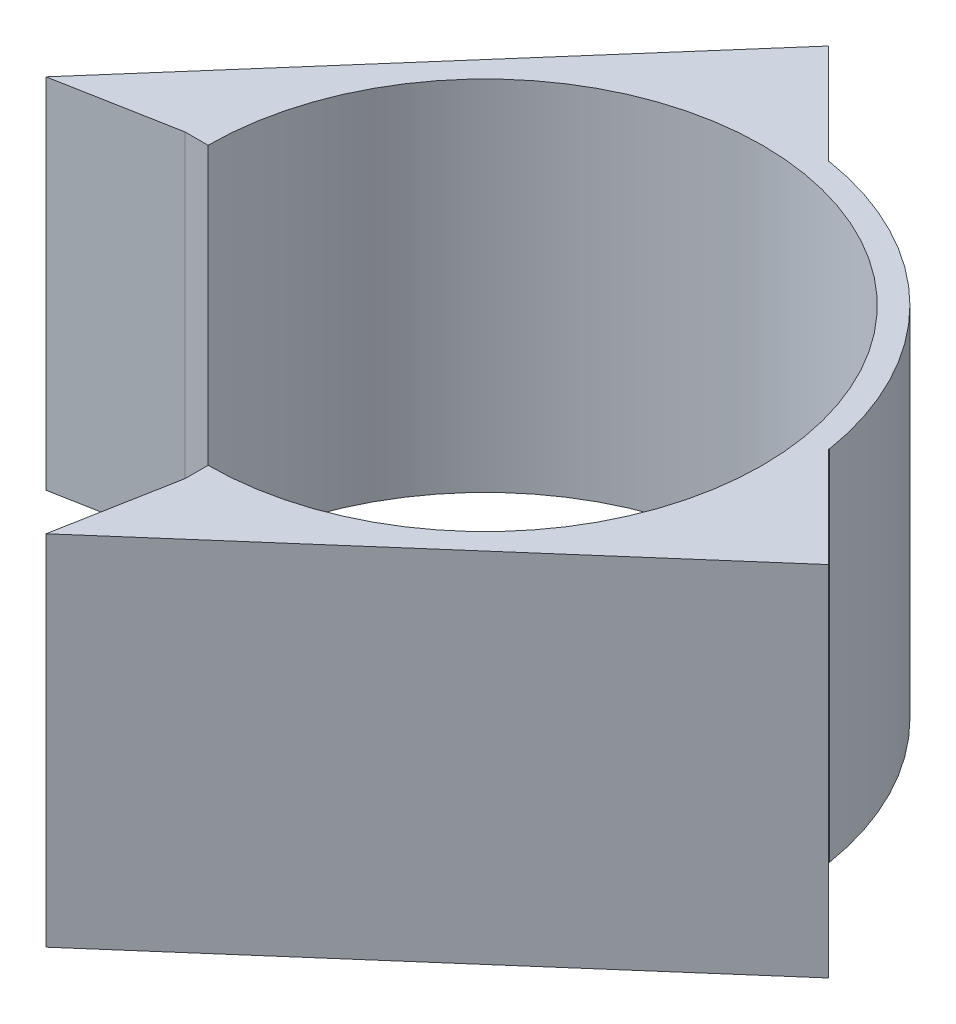
ISO-10303-21;
HEADER;
FILE_DESCRIPTION(('STEP AP214'),'2;1');
FILE_NAME('part.step','',(''),(''),'','','');
FILE_SCHEMA(('AUTOMOTIVE_DESIGN { 1 0 10303 214 1 1 1 1 }'));
ENDSEC;
DATA;
#1=APPLICATION_CONTEXT('core data for automotive mechanical design processes');
#2=APPLICATION_PROTOCOL_DEFINITION('international standard','automotive_design',2000,#1);
#3=PRODUCT_CONTEXT('',#1,'mechanical');
#4=PRODUCT('Part','Part','',(#3));
#5=PRODUCT_RELATED_PRODUCT_CATEGORY('part','',(#4));
#6=PRODUCT_DEFINITION_FORMATION('','',#4);
#7=PRODUCT_DEFINITION_CONTEXT('part definition',#1,'design');
#8=PRODUCT_DEFINITION('design','',#6,#7);
#9=PRODUCT_DEFINITION_SHAPE('','',#8);
#10=(LENGTH_UNIT() NAMED_UNIT(*) SI_UNIT(.MILLI.,.METRE.));
#11=(NAMED_UNIT(*) PLANE_ANGLE_UNIT() SI_UNIT($,.RADIAN.));
#12=(NAMED_UNIT(*) SI_UNIT($,.STERADIAN.) SOLID_ANGLE_UNIT());
#13=UNCERTAINTY_MEASURE_WITH_UNIT(LENGTH_MEASURE(1.E-05),#10,'distance_accuracy_value','');
#14=(GEOMETRIC_REPRESENTATION_CONTEXT(3) GLOBAL_UNCERTAINTY_ASSIGNED_CONTEXT((#13)) GLOBAL_UNIT_ASSIGNED_CONTEXT((#10,
#11,#12)) REPRESENTATION_CONTEXT('',''));
#15=CARTESIAN_POINT('',(0.,0.,0.));
#16=DIRECTION('',(0.,0.,1.));
#17=DIRECTION('',(1.,0.,0.));
#18=AXIS2_PLACEMENT_3D('',#15,#16,#17);
#19=CARTESIAN_POINT('',(0.,62.,0.));
#20=DIRECTION('',(0.,-1.,0.));
#21=DIRECTION('',(0.,0.,-1.));
#22=AXIS2_PLACEMENT_3D('',#19,#20,#21);
#23=CYLINDRICAL_SURFACE('',#22,52.000074421814);
#24=DIRECTION('',(0.,-1.,0.));
#25=VECTOR('',#24,1.);
#26=CARTESIAN_POINT('',(8.22813760226354,62.,-51.3449655903323));
#27=LINE('',#26,#25);
#28=CARTESIAN_POINT('',(8.22813760226354,62.,-51.3449655903323));
#29=VERTEX_POINT('',#28);
#30=CARTESIAN_POINT('',(8.22813760226354,0.,-51.3449655903323));
#31=VERTEX_POINT('',#30);
#32=EDGE_CURVE('E48',#29,#31,#27,.T.);
#33=ORIENTED_EDGE('',*,*,#32,.F.);
#34=CARTESIAN_POINT('',(0.,62.,0.));
#35=DIRECTION('',(0.,1.,0.));
#36=DIRECTION('',(0.,0.,-1.));
#37=AXIS2_PLACEMENT_3D('',#34,#35,#36);
#38=CIRCLE('',#37,52.000074421814);
#39=CARTESIAN_POINT('',(51.3449530492,62.,-8.22821586066177));
#40=VERTEX_POINT('',#39);
#41=EDGE_CURVE('E168',#40,#29,#38,.T.);
#42=ORIENTED_EDGE('',*,*,#41,.F.);
#43=DIRECTION('',(0.,-1.,0.));
#44=VECTOR('',#43,1.);
#45=CARTESIAN_POINT('',(51.3449530492,62.,-8.22821586066177));
#46=LINE('',#45,#44);
#47=CARTESIAN_POINT('',(51.3449530492,0.,-8.22821586066177));
#48=VERTEX_POINT('',#47);
#49=EDGE_CURVE('E150',#40,#48,#46,.T.);
#50=ORIENTED_EDGE('',*,*,#49,.T.);
#51=CARTESIAN_POINT('',(0.,0.,0.));
#52=DIRECTION('',(0.,1.,0.));
#53=DIRECTION('',(0.,0.,-1.));
#54=AXIS2_PLACEMENT_3D('',#51,#52,#53);
#55=CIRCLE('',#54,52.000074421814);
#56=EDGE_CURVE('E187',#48,#31,#55,.T.);
#57=ORIENTED_EDGE('',*,*,#56,.T.);
#58=EDGE_LOOP('',(#33,#42,#50,#57));
#59=FACE_BOUND('',#58,.T.);
#60=ADVANCED_FACE('F33',(#59),#23,.T.);
#61=CARTESIAN_POINT('',(0.,62.,0.));
#62=DIRECTION('',(0.,-1.,0.));
#63=DIRECTION('',(0.,0.,-1.));
#64=AXIS2_PLACEMENT_3D('',#61,#62,#63);
#65=CYLINDRICAL_SURFACE('',#64,48.);
#66=CARTESIAN_POINT('',(0.,0.,0.));
#67=DIRECTION('',(0.,-1.,0.));
#68=DIRECTION('',(0.,0.,-1.));
#69=AXIS2_PLACEMENT_3D('',#66,#67,#68);
#70=CIRCLE('',#69,48.);
#71=CARTESIAN_POINT('',(-47.9999999998207,0.,0.000131195205620602));
#72=VERTEX_POINT('',#71);
#73=CARTESIAN_POINT('',(0.,0.,48.));
#74=VERTEX_POINT('',#73);
#75=EDGE_CURVE('E156',#72,#74,#70,.T.);
#76=ORIENTED_EDGE('',*,*,#75,.T.);
#77=DIRECTION('',(0.,-1.,0.));
#78=VECTOR('',#77,1.);
#79=CARTESIAN_POINT('',(0.,62.,48.));
#80=LINE('',#79,#78);
#81=CARTESIAN_POINT('',(0.,62.,48.));
#82=VERTEX_POINT('',#81);
#83=EDGE_CURVE('E211',#82,#74,#80,.T.);
#84=ORIENTED_EDGE('',*,*,#83,.F.);
#85=CARTESIAN_POINT('',(0.,62.,0.));
#86=DIRECTION('',(0.,-1.,0.));
#87=DIRECTION('',(0.,0.,-1.));
#88=AXIS2_PLACEMENT_3D('',#85,#86,#87);
#89=CIRCLE('',#88,48.);
#90=CARTESIAN_POINT('',(-47.9999999998207,62.,0.000131195205620602));
#91=VERTEX_POINT('',#90);
#92=EDGE_CURVE('E157',#91,#82,#89,.T.);
#93=ORIENTED_EDGE('',*,*,#92,.F.);
#94=DIRECTION('',(0.,-1.,0.));
#95=VECTOR('',#94,1.);
#96=CARTESIAN_POINT('',(-47.9999999998207,62.,0.000131195205620602));
#97=LINE('',#96,#95);
#98=EDGE_CURVE('E177',#91,#72,#97,.T.);
#99=ORIENTED_EDGE('',*,*,#98,.T.);
#100=EDGE_LOOP('',(#76,#84,#93,#99));
#101=FACE_BOUND('',#100,.T.);
#102=ADVANCED_FACE('F35',(#101),#65,.F.);
#103=CARTESIAN_POINT('',(0.,62.,48.));
#104=DIRECTION('',(1.,0.,0.));
#105=DIRECTION('',(0.,0.,-1.));
#106=AXIS2_PLACEMENT_3D('',#103,#104,#105);
#107=PLANE('',#106);
#108=DIRECTION('',(0.,0.,1.));
#109=VECTOR('',#108,1.);
#110=CARTESIAN_POINT('',(0.,0.,48.));
#111=LINE('',#110,#109);
#112=CARTESIAN_POINT('',(0.,0.,52.000074421814));
#113=VERTEX_POINT('',#112);
#114=EDGE_CURVE('E180',#74,#113,#111,.T.);
#115=ORIENTED_EDGE('',*,*,#114,.T.);
#116=DIRECTION('',(0.,-1.,0.));
#117=VECTOR('',#116,1.);
#118=CARTESIAN_POINT('',(0.,62.,52.000074421814));
#119=LINE('',#118,#117);
#120=CARTESIAN_POINT('',(0.,62.,52.000074421814));
#121=VERTEX_POINT('',#120);
#122=EDGE_CURVE('E208',#121,#113,#119,.T.);
#123=ORIENTED_EDGE('',*,*,#122,.F.);
#124=DIRECTION('',(0.,0.,1.));
#125=VECTOR('',#124,1.);
#126=CARTESIAN_POINT('',(0.,62.,48.));
#127=LINE('',#126,#125);
#128=EDGE_CURVE('E160',#82,#121,#127,.T.);
#129=ORIENTED_EDGE('',*,*,#128,.F.);
#130=ORIENTED_EDGE('',*,*,#83,.T.);
#131=EDGE_LOOP('',(#115,#123,#129,#130));
#132=FACE_BOUND('',#131,.T.);
#133=ADVANCED_FACE('F216',(#132),#107,.F.);
#134=CARTESIAN_POINT('',(0.,62.,52.000074421814));
#135=DIRECTION('',(0.983183272944296,0.,0.182621608257462));
#136=DIRECTION('',(0.182621608257462,0.,-0.983183272944296));
#137=AXIS2_PLACEMENT_3D('',#134,#135,#136);
#138=PLANE('',#137);
#139=DIRECTION('',(-0.182621608257462,0.,0.983183272944296));
#140=VECTOR('',#139,1.);
#141=CARTESIAN_POINT('',(0.,0.,52.000074421814));
#142=LINE('',#141,#140);
#143=CARTESIAN_POINT('',(-3.76811930281518,0.,72.2865668272658));
#144=VERTEX_POINT('',#143);
#145=EDGE_CURVE('E182',#113,#144,#142,.T.);
#146=ORIENTED_EDGE('',*,*,#145,.T.);
#147=DIRECTION('',(0.,-1.,0.));
#148=VECTOR('',#147,1.);
#149=CARTESIAN_POINT('',(-3.76811930281518,62.,72.2865668272658));
#150=LINE('',#149,#148);
#151=CARTESIAN_POINT('',(-3.76811930281518,62.,72.2865668272658));
#152=VERTEX_POINT('',#151);
#153=EDGE_CURVE('E205',#152,#144,#150,.T.);
#154=ORIENTED_EDGE('',*,*,#153,.F.);
#155=DIRECTION('',(-0.182621608257462,0.,0.983183272944296));
#156=VECTOR('',#155,1.);
#157=CARTESIAN_POINT('',(0.,62.,52.000074421814));
#158=LINE('',#157,#156);
#159=EDGE_CURVE('E163',#121,#152,#158,.T.);
#160=ORIENTED_EDGE('',*,*,#159,.F.);
#161=ORIENTED_EDGE('',*,*,#122,.T.);
#162=EDGE_LOOP('',(#146,#154,#160,#161));
#163=FACE_BOUND('',#162,.T.);
#164=ADVANCED_FACE('F227',(#163),#138,.F.);
#165=CARTESIAN_POINT('',(-3.76811930281518,62.,72.2865668272658));
#166=DIRECTION('',(-0.657305923288439,0.,-0.753623860563035));
#167=DIRECTION('',(-0.753623860563035,0.,0.657305923288439));
#168=AXIS2_PLACEMENT_3D('',#165,#166,#167);
#169=PLANE('',#168);
#170=DIRECTION('',(0.753623860563035,0.,-0.657305923288439));
#171=VECTOR('',#170,1.);
#172=CARTESIAN_POINT('',(-3.76811930281518,0.,72.2865668272658));
#173=LINE('',#172,#171);
#174=CARTESIAN_POINT('',(68.5797713112362,0.,9.1851981915757));
#175=VERTEX_POINT('',#174);
#176=EDGE_CURVE('E184',#144,#175,#173,.T.);
#177=ORIENTED_EDGE('',*,*,#176,.T.);
#178=DIRECTION('',(0.,-1.,0.));
#179=VECTOR('',#178,1.);
#180=CARTESIAN_POINT('',(68.5797713112362,62.,9.18519819157568));
#181=LINE('',#180,#179);
#182=CARTESIAN_POINT('',(68.5797713112362,62.,9.1851981915757));
#183=VERTEX_POINT('',#182);
#184=EDGE_CURVE('E203',#183,#175,#181,.T.);
#185=ORIENTED_EDGE('',*,*,#184,.F.);
#186=DIRECTION('',(0.753623860563035,0.,-0.657305923288439));
#187=VECTOR('',#186,1.);
#188=CARTESIAN_POINT('',(-3.76811930281518,62.,72.2865668272658));
#189=LINE('',#188,#187);
#190=EDGE_CURVE('E165',#152,#183,#189,.T.);
#191=ORIENTED_EDGE('',*,*,#190,.F.);
#192=ORIENTED_EDGE('',*,*,#153,.T.);
#193=EDGE_LOOP('',(#177,#185,#191,#192));
#194=FACE_BOUND('',#193,.T.);
#195=ADVANCED_FACE('F231',(#194),#169,.F.);
#196=CARTESIAN_POINT('',(-72.2865240752777,62.,3.76818024787527));
#197=DIRECTION('',(0.753624804061433,0.,0.65730484153349));
#198=DIRECTION('',(0.65730484153349,0.,-0.753624804061433));
#199=AXIS2_PLACEMENT_3D('',#196,#197,#198);
#200=PLANE('',#199);
#201=DIRECTION('',(-0.65730484153349,0.,0.753624804061433));
#202=VECTOR('',#201,1.);
#203=CARTESIAN_POINT('',(-72.2865240752777,0.,3.76818024787527));
#204=LINE('',#203,#202);
#205=CARTESIAN_POINT('',(-9.18525928806269,0.,-68.5798009420223));
#206=VERTEX_POINT('',#205);
#207=CARTESIAN_POINT('',(-72.2865240752777,0.,3.76818024787527));
#208=VERTEX_POINT('',#207);
#209=EDGE_CURVE('E126',#206,#208,#204,.T.);
#210=ORIENTED_EDGE('',*,*,#209,.T.);
#211=DIRECTION('',(0.,-1.,0.));
#212=VECTOR('',#211,1.);
#213=CARTESIAN_POINT('',(-72.2865240752777,62.,3.76818024787527));
#214=LINE('',#213,#212);
#215=CARTESIAN_POINT('',(-72.2865240752777,62.,3.76818024787527));
#216=VERTEX_POINT('',#215);
#217=EDGE_CURVE('E198',#216,#208,#214,.T.);
#218=ORIENTED_EDGE('',*,*,#217,.F.);
#219=DIRECTION('',(-0.65730484153349,0.,0.753624804061433));
#220=VECTOR('',#219,1.);
#221=CARTESIAN_POINT('',(-72.2865240752777,62.,3.76818024787527));
#222=LINE('',#221,#220);
#223=CARTESIAN_POINT('',(-9.18525928806269,62.,-68.5798009420223));
#224=VERTEX_POINT('',#223);
#225=EDGE_CURVE('E171',#224,#216,#222,.T.);
#226=ORIENTED_EDGE('',*,*,#225,.F.);
#227=DIRECTION('',(0.,-1.,0.));
#228=VECTOR('',#227,1.);
#229=CARTESIAN_POINT('',(-9.18525928806268,62.,-68.5798009420223));
#230=LINE('',#229,#228);
#231=EDGE_CURVE('E201',#224,#206,#230,.T.);
#232=ORIENTED_EDGE('',*,*,#231,.T.);
#233=EDGE_LOOP('',(#210,#218,#226,#232));
#234=FACE_BOUND('',#233,.T.);
#235=ADVANCED_FACE('F245',(#234),#200,.F.);
#236=CARTESIAN_POINT('',(-72.2865240752777,62.,3.76818024787527));
#237=DIRECTION('',(-0.182618689151109,0.,-0.983183815149909));
#238=DIRECTION('',(-0.983183815149909,0.,0.182618689151109));
#239=AXIS2_PLACEMENT_3D('',#236,#237,#238);
#240=PLANE('',#239);
#241=DIRECTION('',(0.983183815149909,0.,-0.182618689151109));
#242=VECTOR('',#241,1.);
#243=CARTESIAN_POINT('',(-72.2865240752777,0.,3.76818024787527));
#244=LINE('',#243,#242);
#245=CARTESIAN_POINT('',(-52.0000744216485,0.,0.000131195205620602));
#246=VERTEX_POINT('',#245);
#247=EDGE_CURVE('E190',#208,#246,#244,.T.);
#248=ORIENTED_EDGE('',*,*,#247,.T.);
#249=DIRECTION('',(0.,-1.,0.));
#250=VECTOR('',#249,1.);
#251=CARTESIAN_POINT('',(-52.0000744216485,62.,0.000131195205620602));
#252=LINE('',#251,#250);
#253=CARTESIAN_POINT('',(-52.0000744216485,62.,0.000131195205620602));
#254=VERTEX_POINT('',#253);
#255=EDGE_CURVE('E195',#254,#246,#252,.T.);
#256=ORIENTED_EDGE('',*,*,#255,.F.);
#257=DIRECTION('',(0.983183815149909,0.,-0.182618689151109));
#258=VECTOR('',#257,1.);
#259=CARTESIAN_POINT('',(-72.2865240752777,62.,3.76818024787527));
#260=LINE('',#259,#258);
#261=EDGE_CURVE('E173',#216,#254,#260,.T.);
#262=ORIENTED_EDGE('',*,*,#261,.F.);
#263=ORIENTED_EDGE('',*,*,#217,.T.);
#264=EDGE_LOOP('',(#248,#256,#262,#263));
#265=FACE_BOUND('',#264,.T.);
#266=ADVANCED_FACE('F241',(#265),#240,.F.);
#267=CARTESIAN_POINT('',(-52.0000744216485,62.,0.000131195205620602));
#268=DIRECTION('',(0.,0.,-1.));
#269=DIRECTION('',(-1.,0.,0.));
#270=AXIS2_PLACEMENT_3D('',#267,#268,#269);
#271=PLANE('',#270);
#272=DIRECTION('',(1.,0.,0.));
#273=VECTOR('',#272,1.);
#274=CARTESIAN_POINT('',(-52.0000744216485,0.,0.000131195205620602));
#275=LINE('',#274,#273);
#276=EDGE_CURVE('E161',#246,#72,#275,.T.);
#277=ORIENTED_EDGE('',*,*,#276,.T.);
#278=ORIENTED_EDGE('',*,*,#98,.F.);
#279=DIRECTION('',(1.,0.,0.));
#280=VECTOR('',#279,1.);
#281=CARTESIAN_POINT('',(-52.0000744216485,62.,0.000131195205620602));
#282=LINE('',#281,#280);
#283=EDGE_CURVE('E175',#254,#91,#282,.T.);
#284=ORIENTED_EDGE('',*,*,#283,.F.);
#285=ORIENTED_EDGE('',*,*,#255,.T.);
#286=EDGE_LOOP('',(#277,#278,#284,#285));
#287=FACE_BOUND('',#286,.T.);
#288=ADVANCED_FACE('F239',(#287),#271,.F.);
#289=CARTESIAN_POINT('',(0.,62.,0.));
#290=DIRECTION('',(0.,-1.,0.));
#291=DIRECTION('',(0.,0.,-1.));
#292=AXIS2_PLACEMENT_3D('',#289,#290,#291);
#293=PLANE('',#292);
#294=DIRECTION('',(0.707106638129848,0.,-0.707106924243218));
#295=VECTOR('',#294,1.);
#296=CARTESIAN_POINT('',(-21.5584123293755,62.,-21.5584036062959));
#297=LINE('',#296,#295);
#298=CARTESIAN_POINT('',(8.13886035589617,62.,-51.2556883078411));
#299=VERTEX_POINT('',#298);
#300=EDGE_CURVE('E137',#299,#29,#297,.T.);
#301=ORIENTED_EDGE('',*,*,#300,.F.);
#302=DIRECTION('',(-0.707106924243219,0.,-0.707106638129848));
#303=VECTOR('',#302,1.);
#304=CARTESIAN_POINT('',(29.6972726852717,62.,-29.6972847015452));
#305=LINE('',#304,#303);
#306=EDGE_CURVE('E136',#299,#224,#305,.T.);
#307=ORIENTED_EDGE('',*,*,#306,.T.);
#308=ORIENTED_EDGE('',*,*,#225,.T.);
#309=ORIENTED_EDGE('',*,*,#261,.T.);
#310=ORIENTED_EDGE('',*,*,#283,.T.);
#311=ORIENTED_EDGE('',*,*,#92,.T.);
#312=ORIENTED_EDGE('',*,*,#128,.T.);
#313=ORIENTED_EDGE('',*,*,#159,.T.);
#314=ORIENTED_EDGE('',*,*,#190,.T.);
#315=DIRECTION('',(-0.707106924243218,0.,-0.707106638129848));
#316=VECTOR('',#315,1.);
#317=CARTESIAN_POINT('',(29.6972726852716,62.,-29.6972847015452));
#318=LINE('',#317,#316);
#319=CARTESIAN_POINT('',(51.2556516672774,62.,-8.13891444260558));
#320=VERTEX_POINT('',#319);
#321=EDGE_CURVE('E153',#183,#320,#318,.T.);
#322=ORIENTED_EDGE('',*,*,#321,.T.);
#323=DIRECTION('',(0.707106638129848,0.,-0.707106924243218));
#324=VECTOR('',#323,1.);
#325=CARTESIAN_POINT('',(21.5583789820057,62.,21.5583702589396));
#326=LINE('',#325,#324);
#327=EDGE_CURVE('E147',#320,#40,#326,.T.);
#328=ORIENTED_EDGE('',*,*,#327,.T.);
#329=ORIENTED_EDGE('',*,*,#41,.T.);
#330=EDGE_LOOP('',(#301,#307,#308,#309,#310,#311,#312,#313,#314,#322,#328,#329));
#331=FACE_BOUND('',#330,.T.);
#332=ADVANCED_FACE('F234',(#331),#293,.F.);
#333=CARTESIAN_POINT('',(0.,0.,0.));
#334=DIRECTION('',(0.,-1.,0.));
#335=DIRECTION('',(0.,0.,-1.));
#336=AXIS2_PLACEMENT_3D('',#333,#334,#335);
#337=PLANE('',#336);
#338=DIRECTION('',(-0.707106924243219,0.,-0.707106638129848));
#339=VECTOR('',#338,1.);
#340=CARTESIAN_POINT('',(29.6972726852717,0.,-29.6972847015452));
#341=LINE('',#340,#339);
#342=CARTESIAN_POINT('',(8.13886035589617,0.,-51.2556883078411));
#343=VERTEX_POINT('',#342);
#344=EDGE_CURVE('E11',#343,#206,#341,.T.);
#345=ORIENTED_EDGE('',*,*,#344,.F.);
#346=DIRECTION('',(0.707106638129848,0.,-0.707106924243218));
#347=VECTOR('',#346,1.);
#348=CARTESIAN_POINT('',(-21.5584123293755,0.,-21.5584036062959));
#349=LINE('',#348,#347);
#350=EDGE_CURVE('E41',#343,#31,#349,.T.);
#351=ORIENTED_EDGE('',*,*,#350,.T.);
#352=ORIENTED_EDGE('',*,*,#56,.F.);
#353=DIRECTION('',(0.707106638129848,0.,-0.707106924243218));
#354=VECTOR('',#353,1.);
#355=CARTESIAN_POINT('',(51.2556516672774,0.,-8.13891444260558));
#356=LINE('',#355,#354);
#357=CARTESIAN_POINT('',(51.2556516672774,0.,-8.13891444260558));
#358=VERTEX_POINT('',#357);
#359=EDGE_CURVE('E143',#358,#48,#356,.T.);
#360=ORIENTED_EDGE('',*,*,#359,.F.);
#361=DIRECTION('',(-0.707106924243218,0.,-0.707106638129848));
#362=VECTOR('',#361,1.);
#363=CARTESIAN_POINT('',(29.6972726852716,0.,-29.6972847015452));
#364=LINE('',#363,#362);
#365=EDGE_CURVE('E56',#175,#358,#364,.T.);
#366=ORIENTED_EDGE('',*,*,#365,.F.);
#367=ORIENTED_EDGE('',*,*,#176,.F.);
#368=ORIENTED_EDGE('',*,*,#145,.F.);
#369=ORIENTED_EDGE('',*,*,#114,.F.);
#370=ORIENTED_EDGE('',*,*,#75,.F.);
#371=ORIENTED_EDGE('',*,*,#276,.F.);
#372=ORIENTED_EDGE('',*,*,#247,.F.);
#373=ORIENTED_EDGE('',*,*,#209,.F.);
#374=EDGE_LOOP('',(#345,#351,#352,#360,#366,#367,#368,#369,#370,#371,#372,#373));
#375=FACE_BOUND('',#374,.T.);
#376=ADVANCED_FACE('F122',(#375),#337,.T.);
#377=CARTESIAN_POINT('',(51.2556516672774,80.278098871702,-8.13891444260558));
#378=DIRECTION('',(-0.707106638129848,0.,0.707106924243218));
#379=DIRECTION('',(0.707106924243218,0.,0.707106638129848));
#380=AXIS2_PLACEMENT_3D('',#377,#378,#379);
#381=PLANE('',#380);
#382=ORIENTED_EDGE('',*,*,#365,.T.);
#383=DIRECTION('',(0.,-1.,0.));
#384=VECTOR('',#383,1.);
#385=CARTESIAN_POINT('',(51.2556516672774,80.278098871702,-8.13891444260558));
#386=LINE('',#385,#384);
#387=EDGE_CURVE('E145',#320,#358,#386,.T.);
#388=ORIENTED_EDGE('',*,*,#387,.F.);
#389=ORIENTED_EDGE('',*,*,#321,.F.);
#390=ORIENTED_EDGE('',*,*,#184,.T.);
#391=EDGE_LOOP('',(#382,#388,#389,#390));
#392=FACE_BOUND('',#391,.T.);
#393=ADVANCED_FACE('F251',(#392),#381,.F.);
#394=CARTESIAN_POINT('',(21.5583789820057,0.,21.5583702589396));
#395=DIRECTION('',(-0.707106924243218,0.,-0.707106638129848));
#396=DIRECTION('',(-0.707106638129848,0.,0.707106924243218));
#397=AXIS2_PLACEMENT_3D('',#394,#395,#396);
#398=PLANE('',#397);
#399=ORIENTED_EDGE('',*,*,#327,.F.);
#400=ORIENTED_EDGE('',*,*,#387,.T.);
#401=ORIENTED_EDGE('',*,*,#359,.T.);
#402=ORIENTED_EDGE('',*,*,#49,.F.);
#403=EDGE_LOOP('',(#399,#400,#401,#402));
#404=FACE_BOUND('',#403,.T.);
#405=ADVANCED_FACE('F250',(#404),#398,.F.);
#406=CARTESIAN_POINT('',(8.13886035589617,69.7096861776791,-51.2556883078411));
#407=DIRECTION('',(-0.707106638129848,0.,0.707106924243219));
#408=DIRECTION('',(0.707106924243219,0.,0.707106638129848));
#409=AXIS2_PLACEMENT_3D('',#406,#407,#408);
#410=PLANE('',#409);
#411=ORIENTED_EDGE('',*,*,#344,.T.);
#412=ORIENTED_EDGE('',*,*,#231,.F.);
#413=ORIENTED_EDGE('',*,*,#306,.F.);
#414=DIRECTION('',(0.,1.,0.));
#415=VECTOR('',#414,1.);
#416=CARTESIAN_POINT('',(8.13886035589617,69.7096861776791,-51.2556883078411));
#417=LINE('',#416,#415);
#418=EDGE_CURVE('E132',#343,#299,#417,.T.);
#419=ORIENTED_EDGE('',*,*,#418,.F.);
#420=EDGE_LOOP('',(#411,#412,#413,#419));
#421=FACE_BOUND('',#420,.T.);
#422=ADVANCED_FACE('F134',(#421),#410,.F.);
#423=CARTESIAN_POINT('',(-21.5584123293755,0.,-21.5584036062959));
#424=DIRECTION('',(-0.707106924243218,0.,-0.707106638129848));
#425=DIRECTION('',(-0.707106638129848,0.,0.707106924243218));
#426=AXIS2_PLACEMENT_3D('',#423,#424,#425);
#427=PLANE('',#426);
#428=ORIENTED_EDGE('',*,*,#32,.T.);
#429=ORIENTED_EDGE('',*,*,#350,.F.);
#430=ORIENTED_EDGE('',*,*,#418,.T.);
#431=ORIENTED_EDGE('',*,*,#300,.T.);
#432=EDGE_LOOP('',(#428,#429,#430,#431));
#433=FACE_BOUND('',#432,.T.);
#434=ADVANCED_FACE('F131',(#433),#427,.T.);
#435=CLOSED_SHELL('',(#60,#102,#133,#164,#195,#235,#266,#288,#332,#376,#393,#405,#422,#434));
#436=MANIFOLD_SOLID_BREP('B2',#435);
#437=ADVANCED_BREP_SHAPE_REPRESENTATION('',(#18,#436),#14);
#438=SHAPE_DEFINITION_REPRESENTATION(#9,#437);
ENDSEC;
END-ISO-10303-21;
